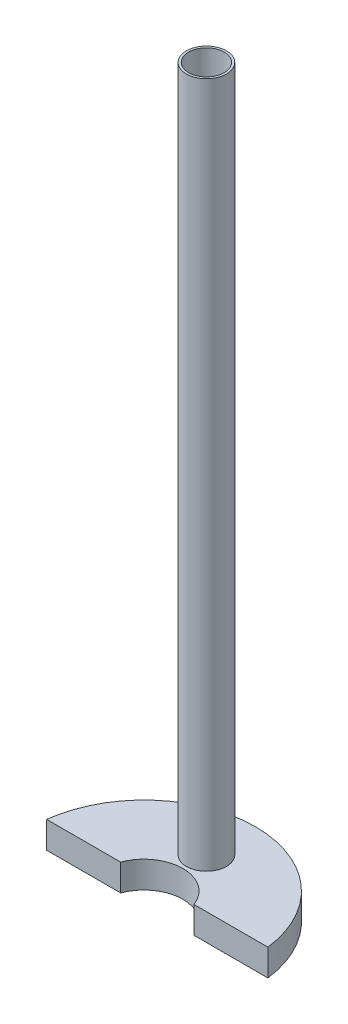
ISO-10303-21;
HEADER;
FILE_DESCRIPTION(('STEP AP214'),'2;1');
FILE_NAME('part.step','',(''),(''),'','','');
FILE_SCHEMA(('AUTOMOTIVE_DESIGN { 1 0 10303 214 1 1 1 1 }'));
ENDSEC;
DATA;
#1=APPLICATION_CONTEXT('core data for automotive mechanical design processes');
#2=APPLICATION_PROTOCOL_DEFINITION('international standard','automotive_design',2000,#1);
#3=PRODUCT_CONTEXT('',#1,'mechanical');
#4=PRODUCT('Part','Part','',(#3));
#5=PRODUCT_RELATED_PRODUCT_CATEGORY('part','',(#4));
#6=PRODUCT_DEFINITION_FORMATION('','',#4);
#7=PRODUCT_DEFINITION_CONTEXT('part definition',#1,'design');
#8=PRODUCT_DEFINITION('design','',#6,#7);
#9=PRODUCT_DEFINITION_SHAPE('','',#8);
#10=(LENGTH_UNIT() NAMED_UNIT(*) SI_UNIT(.MILLI.,.METRE.));
#11=(NAMED_UNIT(*) PLANE_ANGLE_UNIT() SI_UNIT($,.RADIAN.));
#12=(NAMED_UNIT(*) SI_UNIT($,.STERADIAN.) SOLID_ANGLE_UNIT());
#13=UNCERTAINTY_MEASURE_WITH_UNIT(LENGTH_MEASURE(1.E-05),#10,'distance_accuracy_value','');
#14=(GEOMETRIC_REPRESENTATION_CONTEXT(3) GLOBAL_UNCERTAINTY_ASSIGNED_CONTEXT((#13)) GLOBAL_UNIT_ASSIGNED_CONTEXT((#10,
#11,#12)) REPRESENTATION_CONTEXT('',''));
#15=CARTESIAN_POINT('',(0.,0.,0.));
#16=DIRECTION('',(0.,0.,1.));
#17=DIRECTION('',(1.,0.,0.));
#18=AXIS2_PLACEMENT_3D('',#15,#16,#17);
#19=CARTESIAN_POINT('',(0.,3.,0.));
#20=DIRECTION('',(0.,-1.,0.));
#21=DIRECTION('',(0.,0.,-1.));
#22=AXIS2_PLACEMENT_3D('',#19,#20,#21);
#23=CYLINDRICAL_SURFACE('',#22,4.375);
#24=CARTESIAN_POINT('',(0.,0.,0.));
#25=DIRECTION('',(0.,1.,0.));
#26=DIRECTION('',(0.,0.,1.));
#27=AXIS2_PLACEMENT_3D('',#24,#25,#26);
#28=CIRCLE('',#27,4.375);
#29=CARTESIAN_POINT('',(4.1098205556934,0.,-1.5));
#30=VERTEX_POINT('',#29);
#31=CARTESIAN_POINT('',(-4.1098205556934,0.,-1.5));
#32=VERTEX_POINT('',#31);
#33=EDGE_CURVE('E115',#30,#32,#28,.T.);
#34=ORIENTED_EDGE('',*,*,#33,.F.);
#35=DIRECTION('',(0.,-1.,0.));
#36=VECTOR('',#35,1.);
#37=CARTESIAN_POINT('',(4.1098205556934,3.,-1.5));
#38=LINE('',#37,#36);
#39=CARTESIAN_POINT('',(4.1098205556934,3.,-1.5));
#40=VERTEX_POINT('',#39);
#41=EDGE_CURVE('E11',#40,#30,#38,.T.);
#42=ORIENTED_EDGE('',*,*,#41,.F.);
#43=CARTESIAN_POINT('',(0.,3.,0.));
#44=DIRECTION('',(0.,1.,0.));
#45=DIRECTION('',(0.,0.,1.));
#46=AXIS2_PLACEMENT_3D('',#43,#44,#45);
#47=CIRCLE('',#46,4.375);
#48=CARTESIAN_POINT('',(-4.1098205556934,3.,-1.5));
#49=VERTEX_POINT('',#48);
#50=EDGE_CURVE('E99',#40,#49,#47,.T.);
#51=ORIENTED_EDGE('',*,*,#50,.T.);
#52=DIRECTION('',(0.,-1.,0.));
#53=VECTOR('',#52,1.);
#54=CARTESIAN_POINT('',(-4.1098205556934,3.,-1.5));
#55=LINE('',#54,#53);
#56=EDGE_CURVE('E88',#49,#32,#55,.T.);
#57=ORIENTED_EDGE('',*,*,#56,.T.);
#58=EDGE_LOOP('',(#34,#42,#51,#57));
#59=FACE_BOUND('',#58,.T.);
#60=ADVANCED_FACE('F47',(#59),#23,.F.);
#61=CARTESIAN_POINT('',(0.,3.,-1.5));
#62=DIRECTION('',(0.,0.,-1.));
#63=DIRECTION('',(-1.,0.,0.));
#64=AXIS2_PLACEMENT_3D('',#61,#62,#63);
#65=PLANE('',#64);
#66=DIRECTION('',(1.,0.,0.));
#67=VECTOR('',#66,1.);
#68=CARTESIAN_POINT('',(0.,0.,-1.5));
#69=LINE('',#68,#67);
#70=CARTESIAN_POINT('',(12.4096736459909,0.,-1.5));
#71=VERTEX_POINT('',#70);
#72=EDGE_CURVE('E105',#30,#71,#69,.T.);
#73=ORIENTED_EDGE('',*,*,#72,.T.);
#74=DIRECTION('',(0.,-1.,0.));
#75=VECTOR('',#74,1.);
#76=CARTESIAN_POINT('',(12.4096736459909,3.,-1.5));
#77=LINE('',#76,#75);
#78=CARTESIAN_POINT('',(12.4096736459909,3.,-1.5));
#79=VERTEX_POINT('',#78);
#80=EDGE_CURVE('E57',#79,#71,#77,.T.);
#81=ORIENTED_EDGE('',*,*,#80,.F.);
#82=DIRECTION('',(1.,0.,0.));
#83=VECTOR('',#82,1.);
#84=CARTESIAN_POINT('',(0.,3.,-1.5));
#85=LINE('',#84,#83);
#86=EDGE_CURVE('E94',#40,#79,#85,.T.);
#87=ORIENTED_EDGE('',*,*,#86,.F.);
#88=ORIENTED_EDGE('',*,*,#41,.T.);
#89=EDGE_LOOP('',(#73,#81,#87,#88));
#90=FACE_BOUND('',#89,.T.);
#91=ADVANCED_FACE('F103',(#90),#65,.F.);
#92=CARTESIAN_POINT('',(0.,3.,0.));
#93=DIRECTION('',(0.,-1.,0.));
#94=DIRECTION('',(0.,0.,-1.));
#95=AXIS2_PLACEMENT_3D('',#92,#93,#94);
#96=CYLINDRICAL_SURFACE('',#95,12.5);
#97=CARTESIAN_POINT('',(0.,0.,0.));
#98=DIRECTION('',(0.,1.,0.));
#99=DIRECTION('',(0.,0.,1.));
#100=AXIS2_PLACEMENT_3D('',#97,#98,#99);
#101=CIRCLE('',#100,12.5);
#102=CARTESIAN_POINT('',(-12.4096736459909,0.,-1.5));
#103=VERTEX_POINT('',#102);
#104=EDGE_CURVE('E81',#71,#103,#101,.T.);
#105=ORIENTED_EDGE('',*,*,#104,.T.);
#106=DIRECTION('',(0.,-1.,0.));
#107=VECTOR('',#106,1.);
#108=CARTESIAN_POINT('',(-12.4096736459909,3.,-1.5));
#109=LINE('',#108,#107);
#110=CARTESIAN_POINT('',(-12.4096736459909,3.,-1.5));
#111=VERTEX_POINT('',#110);
#112=EDGE_CURVE('E107',#111,#103,#109,.T.);
#113=ORIENTED_EDGE('',*,*,#112,.F.);
#114=CARTESIAN_POINT('',(0.,3.,0.));
#115=DIRECTION('',(0.,1.,0.));
#116=DIRECTION('',(0.,0.,1.));
#117=AXIS2_PLACEMENT_3D('',#114,#115,#116);
#118=CIRCLE('',#117,12.5);
#119=EDGE_CURVE('E98',#79,#111,#118,.T.);
#120=ORIENTED_EDGE('',*,*,#119,.F.);
#121=ORIENTED_EDGE('',*,*,#80,.T.);
#122=EDGE_LOOP('',(#105,#113,#120,#121));
#123=FACE_BOUND('',#122,.T.);
#124=ADVANCED_FACE('F109',(#123),#96,.T.);
#125=EDGE_CURVE('E122',#103,#32,#69,.T.);
#126=ORIENTED_EDGE('',*,*,#125,.T.);
#127=ORIENTED_EDGE('',*,*,#56,.F.);
#128=EDGE_CURVE('E65',#111,#49,#85,.T.);
#129=ORIENTED_EDGE('',*,*,#128,.F.);
#130=ORIENTED_EDGE('',*,*,#112,.T.);
#131=EDGE_LOOP('',(#126,#127,#129,#130));
#132=FACE_BOUND('',#131,.T.);
#133=ADVANCED_FACE('F130',(#132),#65,.F.);
#134=CARTESIAN_POINT('',(0.,3.,0.));
#135=DIRECTION('',(0.,1.,0.));
#136=DIRECTION('',(0.,0.,1.));
#137=AXIS2_PLACEMENT_3D('',#134,#135,#136);
#138=PLANE('',#137);
#139=CARTESIAN_POINT('',(0.,3.,-7.01108548099583));
#140=DIRECTION('',(0.,1.,0.));
#141=DIRECTION('',(0.,0.,1.));
#142=AXIS2_PLACEMENT_3D('',#139,#140,#141);
#143=CIRCLE('',#142,2.25);
#144=CARTESIAN_POINT('',(0.,3.,-4.76108548099583));
#145=VERTEX_POINT('',#144);
#146=EDGE_CURVE('E119',#145,#145,#143,.F.);
#147=ORIENTED_EDGE('',*,*,#146,.T.);
#148=EDGE_LOOP('',(#147));
#149=FACE_BOUND('',#148,.T.);
#150=ORIENTED_EDGE('',*,*,#50,.F.);
#151=ORIENTED_EDGE('',*,*,#86,.T.);
#152=ORIENTED_EDGE('',*,*,#119,.T.);
#153=ORIENTED_EDGE('',*,*,#128,.T.);
#154=EDGE_LOOP('',(#150,#151,#152,#153));
#155=FACE_BOUND('',#154,.T.);
#156=ADVANCED_FACE('F96',(#149,#155),#138,.T.);
#157=CARTESIAN_POINT('',(0.,0.,0.));
#158=DIRECTION('',(0.,1.,0.));
#159=DIRECTION('',(0.,0.,1.));
#160=AXIS2_PLACEMENT_3D('',#157,#158,#159);
#161=PLANE('',#160);
#162=CARTESIAN_POINT('',(0.,0.,-7.01108548099583));
#163=DIRECTION('',(0.,1.,0.));
#164=DIRECTION('',(0.,0.,1.));
#165=AXIS2_PLACEMENT_3D('',#162,#163,#164);
#166=CIRCLE('',#165,2.);
#167=CARTESIAN_POINT('',(0.,0.,-5.01108548099583));
#168=VERTEX_POINT('',#167);
#169=EDGE_CURVE('E143',#168,#168,#166,.T.);
#170=ORIENTED_EDGE('',*,*,#169,.T.);
#171=EDGE_LOOP('',(#170));
#172=FACE_BOUND('',#171,.T.);
#173=ORIENTED_EDGE('',*,*,#33,.T.);
#174=ORIENTED_EDGE('',*,*,#125,.F.);
#175=ORIENTED_EDGE('',*,*,#104,.F.);
#176=ORIENTED_EDGE('',*,*,#72,.F.);
#177=EDGE_LOOP('',(#173,#174,#175,#176));
#178=FACE_BOUND('',#177,.T.);
#179=ADVANCED_FACE('F132',(#172,#178),#161,.F.);
#180=CARTESIAN_POINT('',(0.,80.,-7.01108548099583));
#181=DIRECTION('',(0.,-1.,0.));
#182=DIRECTION('',(0.,0.,-1.));
#183=AXIS2_PLACEMENT_3D('',#180,#181,#182);
#184=CYLINDRICAL_SURFACE('',#183,2.25);
#185=ORIENTED_EDGE('',*,*,#146,.F.);
#186=EDGE_LOOP('',(#185));
#187=FACE_BOUND('',#186,.T.);
#188=CARTESIAN_POINT('',(0.,80.,-7.01108548099583));
#189=DIRECTION('',(0.,1.,0.));
#190=DIRECTION('',(0.,0.,1.));
#191=AXIS2_PLACEMENT_3D('',#188,#189,#190);
#192=CIRCLE('',#191,2.25);
#193=CARTESIAN_POINT('',(0.,80.,-4.76108548099583));
#194=VERTEX_POINT('',#193);
#195=EDGE_CURVE('E139',#194,#194,#192,.T.);
#196=ORIENTED_EDGE('',*,*,#195,.F.);
#197=EDGE_LOOP('',(#196));
#198=FACE_BOUND('',#197,.T.);
#199=ADVANCED_FACE('F158',(#187,#198),#184,.T.);
#200=CARTESIAN_POINT('',(0.,80.,0.));
#201=DIRECTION('',(0.,1.,0.));
#202=DIRECTION('',(0.,0.,1.));
#203=AXIS2_PLACEMENT_3D('',#200,#201,#202);
#204=PLANE('',#203);
#205=CARTESIAN_POINT('',(0.,80.,-7.01108548099583));
#206=DIRECTION('',(0.,1.,0.));
#207=DIRECTION('',(0.,0.,1.));
#208=AXIS2_PLACEMENT_3D('',#205,#206,#207);
#209=CIRCLE('',#208,2.);
#210=CARTESIAN_POINT('',(0.,80.,-5.01108548099583));
#211=VERTEX_POINT('',#210);
#212=EDGE_CURVE('E50',#211,#211,#209,.T.);
#213=ORIENTED_EDGE('',*,*,#212,.F.);
#214=EDGE_LOOP('',(#213));
#215=FACE_BOUND('',#214,.T.);
#216=ORIENTED_EDGE('',*,*,#195,.T.);
#217=EDGE_LOOP('',(#216));
#218=FACE_BOUND('',#217,.T.);
#219=ADVANCED_FACE('F155',(#215,#218),#204,.T.);
#220=CARTESIAN_POINT('',(0.,0.,-7.01108548099583));
#221=DIRECTION('',(0.,1.,0.));
#222=DIRECTION('',(0.,0.,1.));
#223=AXIS2_PLACEMENT_3D('',#220,#221,#222);
#224=CYLINDRICAL_SURFACE('',#223,2.);
#225=ORIENTED_EDGE('',*,*,#212,.T.);
#226=EDGE_LOOP('',(#225));
#227=FACE_BOUND('',#226,.T.);
#228=ORIENTED_EDGE('',*,*,#169,.F.);
#229=EDGE_LOOP('',(#228));
#230=FACE_BOUND('',#229,.T.);
#231=ADVANCED_FACE('F152',(#227,#230),#224,.F.);
#232=CLOSED_SHELL('',(#60,#91,#124,#133,#156,#179,#199,#219,#231));
#233=MANIFOLD_SOLID_BREP('B2',#232);
#234=ADVANCED_BREP_SHAPE_REPRESENTATION('',(#18,#233),#14);
#235=SHAPE_DEFINITION_REPRESENTATION(#9,#234);
ENDSEC;
END-ISO-10303-21;
